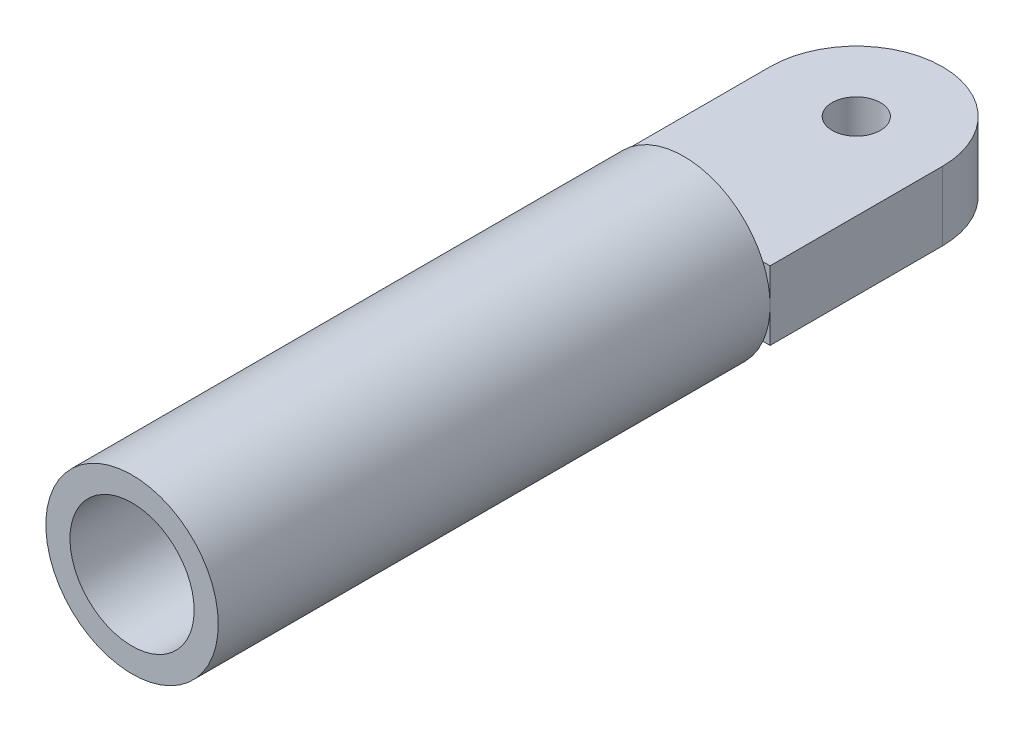
ISO-10303-21;
HEADER;
FILE_DESCRIPTION(('STEP AP214'),'2;1');
FILE_NAME('part.step','',(''),(''),'','','');
FILE_SCHEMA(('AUTOMOTIVE_DESIGN { 1 0 10303 214 1 1 1 1 }'));
ENDSEC;
DATA;
#1=APPLICATION_CONTEXT('core data for automotive mechanical design processes');
#2=APPLICATION_PROTOCOL_DEFINITION('international standard','automotive_design',2000,#1);
#3=PRODUCT_CONTEXT('',#1,'mechanical');
#4=PRODUCT('Part','Part','',(#3));
#5=PRODUCT_RELATED_PRODUCT_CATEGORY('part','',(#4));
#6=PRODUCT_DEFINITION_FORMATION('','',#4);
#7=PRODUCT_DEFINITION_CONTEXT('part definition',#1,'design');
#8=PRODUCT_DEFINITION('design','',#6,#7);
#9=PRODUCT_DEFINITION_SHAPE('','',#8);
#10=(LENGTH_UNIT() NAMED_UNIT(*) SI_UNIT(.MILLI.,.METRE.));
#11=(NAMED_UNIT(*) PLANE_ANGLE_UNIT() SI_UNIT($,.RADIAN.));
#12=(NAMED_UNIT(*) SI_UNIT($,.STERADIAN.) SOLID_ANGLE_UNIT());
#13=UNCERTAINTY_MEASURE_WITH_UNIT(LENGTH_MEASURE(1.E-05),#10,'distance_accuracy_value','');
#14=(GEOMETRIC_REPRESENTATION_CONTEXT(3) GLOBAL_UNCERTAINTY_ASSIGNED_CONTEXT((#13)) GLOBAL_UNIT_ASSIGNED_CONTEXT((#10,
#11,#12)) REPRESENTATION_CONTEXT('',''));
#15=CARTESIAN_POINT('',(0.,0.,0.));
#16=DIRECTION('',(0.,0.,1.));
#17=DIRECTION('',(1.,0.,0.));
#18=AXIS2_PLACEMENT_3D('',#15,#16,#17);
#19=CARTESIAN_POINT('',(0.,0.,0.));
#20=DIRECTION('',(0.,0.,1.));
#21=DIRECTION('',(1.,0.,0.));
#22=AXIS2_PLACEMENT_3D('',#19,#20,#21);
#23=PLANE('',#22);
#24=DIRECTION('',(1.,0.,0.));
#25=VECTOR('',#24,1.);
#26=CARTESIAN_POINT('',(-12.5,5.,0.));
#27=LINE('',#26,#25);
#28=CARTESIAN_POINT('',(-11.4564392373896,5.,0.));
#29=VERTEX_POINT('',#28);
#30=CARTESIAN_POINT('',(-7.48331477354788,5.,0.));
#31=VERTEX_POINT('',#30);
#32=EDGE_CURVE('E153',#29,#31,#27,.T.);
#33=ORIENTED_EDGE('',*,*,#32,.F.);
#34=CARTESIAN_POINT('',(0.,0.,0.));
#35=DIRECTION('',(0.,0.,1.));
#36=DIRECTION('',(1.,0.,0.));
#37=AXIS2_PLACEMENT_3D('',#34,#35,#36);
#38=CIRCLE('',#37,12.5);
#39=CARTESIAN_POINT('',(11.4564392373896,5.,0.));
#40=VERTEX_POINT('',#39);
#41=EDGE_CURVE('E154',#40,#29,#38,.T.);
#42=ORIENTED_EDGE('',*,*,#41,.F.);
#43=CARTESIAN_POINT('',(7.48331477354788,5.,0.));
#44=VERTEX_POINT('',#43);
#45=EDGE_CURVE('E120',#44,#40,#27,.T.);
#46=ORIENTED_EDGE('',*,*,#45,.F.);
#47=CARTESIAN_POINT('',(0.,0.,0.));
#48=DIRECTION('',(0.,0.,1.));
#49=DIRECTION('',(1.,0.,0.));
#50=AXIS2_PLACEMENT_3D('',#47,#48,#49);
#51=CIRCLE('',#50,9.);
#52=EDGE_CURVE('E139',#44,#31,#51,.T.);
#53=ORIENTED_EDGE('',*,*,#52,.T.);
#54=EDGE_LOOP('',(#33,#42,#46,#53));
#55=FACE_BOUND('',#54,.T.);
#56=ADVANCED_FACE('F34',(#55),#23,.F.);
#57=CARTESIAN_POINT('',(0.,0.,80.));
#58=DIRECTION('',(0.,0.,1.));
#59=DIRECTION('',(1.,0.,0.));
#60=AXIS2_PLACEMENT_3D('',#57,#58,#59);
#61=PLANE('',#60);
#62=CARTESIAN_POINT('',(0.,0.,80.));
#63=DIRECTION('',(0.,0.,1.));
#64=DIRECTION('',(1.,0.,0.));
#65=AXIS2_PLACEMENT_3D('',#62,#63,#64);
#66=CIRCLE('',#65,12.5);
#67=CARTESIAN_POINT('',(12.5,0.,80.));
#68=VERTEX_POINT('',#67);
#69=EDGE_CURVE('E148',#68,#68,#66,.T.);
#70=ORIENTED_EDGE('',*,*,#69,.T.);
#71=EDGE_LOOP('',(#70));
#72=FACE_BOUND('',#71,.T.);
#73=CARTESIAN_POINT('',(0.,0.,80.));
#74=DIRECTION('',(0.,0.,1.));
#75=DIRECTION('',(1.,0.,0.));
#76=AXIS2_PLACEMENT_3D('',#73,#74,#75);
#77=CIRCLE('',#76,9.);
#78=CARTESIAN_POINT('',(9.,0.,80.));
#79=VERTEX_POINT('',#78);
#80=EDGE_CURVE('E144',#79,#79,#77,.T.);
#81=ORIENTED_EDGE('',*,*,#80,.F.);
#82=EDGE_LOOP('',(#81));
#83=FACE_BOUND('',#82,.T.);
#84=ADVANCED_FACE('F221',(#72,#83),#61,.T.);
#85=CARTESIAN_POINT('',(-11.4564392373896,-5.,0.));
#86=VERTEX_POINT('',#85);
#87=CARTESIAN_POINT('',(11.4564392373896,-5.,0.));
#88=VERTEX_POINT('',#87);
#89=EDGE_CURVE('E159',#86,#88,#38,.T.);
#90=ORIENTED_EDGE('',*,*,#89,.F.);
#91=DIRECTION('',(1.,0.,0.));
#92=VECTOR('',#91,1.);
#93=CARTESIAN_POINT('',(-12.5,-5.,0.));
#94=LINE('',#93,#92);
#95=CARTESIAN_POINT('',(-7.48331477354788,-5.,0.));
#96=VERTEX_POINT('',#95);
#97=EDGE_CURVE('E11',#86,#96,#94,.T.);
#98=ORIENTED_EDGE('',*,*,#97,.T.);
#99=CARTESIAN_POINT('',(7.48331477354788,-5.,0.));
#100=VERTEX_POINT('',#99);
#101=EDGE_CURVE('E137',#96,#100,#51,.T.);
#102=ORIENTED_EDGE('',*,*,#101,.T.);
#103=EDGE_CURVE('E43',#100,#88,#94,.T.);
#104=ORIENTED_EDGE('',*,*,#103,.T.);
#105=EDGE_LOOP('',(#90,#98,#102,#104));
#106=FACE_BOUND('',#105,.T.);
#107=ADVANCED_FACE('F223',(#106),#23,.F.);
#108=CARTESIAN_POINT('',(0.,0.,80.));
#109=DIRECTION('',(0.,0.,-1.));
#110=DIRECTION('',(-1.,0.,0.));
#111=AXIS2_PLACEMENT_3D('',#108,#109,#110);
#112=CYLINDRICAL_SURFACE('',#111,12.5);
#113=ORIENTED_EDGE('',*,*,#69,.F.);
#114=EDGE_LOOP('',(#113));
#115=FACE_BOUND('',#114,.T.);
#116=CARTESIAN_POINT('',(12.5,0.,0.));
#117=VERTEX_POINT('',#116);
#118=EDGE_CURVE('E38',#117,#40,#38,.T.);
#119=ORIENTED_EDGE('',*,*,#118,.T.);
#120=ORIENTED_EDGE('',*,*,#41,.T.);
#121=CARTESIAN_POINT('',(-12.5,0.,0.));
#122=VERTEX_POINT('',#121);
#123=EDGE_CURVE('E113',#29,#122,#38,.T.);
#124=ORIENTED_EDGE('',*,*,#123,.T.);
#125=EDGE_CURVE('E162',#122,#86,#38,.T.);
#126=ORIENTED_EDGE('',*,*,#125,.T.);
#127=ORIENTED_EDGE('',*,*,#89,.T.);
#128=EDGE_CURVE('E146',#88,#117,#38,.T.);
#129=ORIENTED_EDGE('',*,*,#128,.T.);
#130=EDGE_LOOP('',(#119,#120,#124,#126,#127,#129));
#131=FACE_BOUND('',#130,.T.);
#132=ADVANCED_FACE('F36',(#115,#131),#112,.T.);
#133=CARTESIAN_POINT('',(0.,0.,80.));
#134=DIRECTION('',(0.,0.,-1.));
#135=DIRECTION('',(-1.,0.,0.));
#136=AXIS2_PLACEMENT_3D('',#133,#134,#135);
#137=CYLINDRICAL_SURFACE('',#136,9.);
#138=ORIENTED_EDGE('',*,*,#80,.T.);
#139=EDGE_LOOP('',(#138));
#140=FACE_BOUND('',#139,.T.);
#141=ORIENTED_EDGE('',*,*,#52,.F.);
#142=EDGE_CURVE('E52',#100,#44,#51,.T.);
#143=ORIENTED_EDGE('',*,*,#142,.F.);
#144=ORIENTED_EDGE('',*,*,#101,.F.);
#145=EDGE_CURVE('E147',#31,#96,#51,.T.);
#146=ORIENTED_EDGE('',*,*,#145,.F.);
#147=EDGE_LOOP('',(#141,#143,#144,#146));
#148=FACE_BOUND('',#147,.T.);
#149=ADVANCED_FACE('F232',(#140,#148),#137,.F.);
#150=CARTESIAN_POINT('',(-12.5,5.,0.));
#151=DIRECTION('',(0.,0.,-1.));
#152=DIRECTION('',(-1.,0.,0.));
#153=AXIS2_PLACEMENT_3D('',#150,#151,#152);
#154=PLANE('',#153);
#155=ORIENTED_EDGE('',*,*,#123,.F.);
#156=CARTESIAN_POINT('',(-12.5,5.,0.));
#157=VERTEX_POINT('',#156);
#158=EDGE_CURVE('E108',#157,#29,#27,.T.);
#159=ORIENTED_EDGE('',*,*,#158,.F.);
#160=DIRECTION('',(0.,-1.,0.));
#161=VECTOR('',#160,1.);
#162=CARTESIAN_POINT('',(-12.5,5.,0.));
#163=LINE('',#162,#161);
#164=EDGE_CURVE('E112',#157,#122,#163,.T.);
#165=ORIENTED_EDGE('',*,*,#164,.T.);
#166=EDGE_LOOP('',(#155,#159,#165));
#167=FACE_BOUND('',#166,.T.);
#168=ADVANCED_FACE('F110',(#167),#154,.F.);
#169=ORIENTED_EDGE('',*,*,#118,.F.);
#170=DIRECTION('',(0.,-1.,0.));
#171=VECTOR('',#170,1.);
#172=CARTESIAN_POINT('',(12.5,5.,0.));
#173=LINE('',#172,#171);
#174=CARTESIAN_POINT('',(12.5,5.,0.));
#175=VERTEX_POINT('',#174);
#176=EDGE_CURVE('E140',#175,#117,#173,.T.);
#177=ORIENTED_EDGE('',*,*,#176,.F.);
#178=EDGE_CURVE('E119',#40,#175,#27,.T.);
#179=ORIENTED_EDGE('',*,*,#178,.F.);
#180=EDGE_LOOP('',(#169,#177,#179));
#181=FACE_BOUND('',#180,.T.);
#182=ADVANCED_FACE('F189',(#181),#154,.F.);
#183=EDGE_CURVE('E117',#31,#44,#27,.T.);
#184=ORIENTED_EDGE('',*,*,#183,.F.);
#185=ORIENTED_EDGE('',*,*,#145,.T.);
#186=EDGE_CURVE('E45',#96,#100,#94,.T.);
#187=ORIENTED_EDGE('',*,*,#186,.T.);
#188=ORIENTED_EDGE('',*,*,#142,.T.);
#189=EDGE_LOOP('',(#184,#185,#187,#188));
#190=FACE_BOUND('',#189,.T.);
#191=ADVANCED_FACE('F256',(#190),#154,.F.);
#192=ORIENTED_EDGE('',*,*,#125,.F.);
#193=CARTESIAN_POINT('',(-12.5,-5.,0.));
#194=VERTEX_POINT('',#193);
#195=EDGE_CURVE('E135',#122,#194,#163,.T.);
#196=ORIENTED_EDGE('',*,*,#195,.T.);
#197=EDGE_CURVE('E169',#194,#86,#94,.T.);
#198=ORIENTED_EDGE('',*,*,#197,.T.);
#199=EDGE_LOOP('',(#192,#196,#198));
#200=FACE_BOUND('',#199,.T.);
#201=ADVANCED_FACE('F167',(#200),#154,.F.);
#202=CARTESIAN_POINT('',(0.,5.,-25.));
#203=DIRECTION('',(0.,-1.,0.));
#204=DIRECTION('',(0.,0.,-1.));
#205=AXIS2_PLACEMENT_3D('',#202,#203,#204);
#206=PLANE('',#205);
#207=DIRECTION('',(0.,0.,1.));
#208=VECTOR('',#207,1.);
#209=CARTESIAN_POINT('',(-12.5,5.,0.));
#210=LINE('',#209,#208);
#211=CARTESIAN_POINT('',(-12.5,5.,-25.));
#212=VERTEX_POINT('',#211);
#213=EDGE_CURVE('E122',#212,#157,#210,.T.);
#214=ORIENTED_EDGE('',*,*,#213,.T.);
#215=ORIENTED_EDGE('',*,*,#158,.T.);
#216=ORIENTED_EDGE('',*,*,#32,.T.);
#217=ORIENTED_EDGE('',*,*,#183,.T.);
#218=ORIENTED_EDGE('',*,*,#45,.T.);
#219=ORIENTED_EDGE('',*,*,#178,.T.);
#220=DIRECTION('',(0.,0.,-1.));
#221=VECTOR('',#220,1.);
#222=CARTESIAN_POINT('',(12.5,5.,0.));
#223=LINE('',#222,#221);
#224=CARTESIAN_POINT('',(12.5,5.,-25.));
#225=VERTEX_POINT('',#224);
#226=EDGE_CURVE('E116',#175,#225,#223,.T.);
#227=ORIENTED_EDGE('',*,*,#226,.T.);
#228=CARTESIAN_POINT('',(0.,5.,-25.));
#229=DIRECTION('',(0.,1.,0.));
#230=DIRECTION('',(0.,0.,-1.));
#231=AXIS2_PLACEMENT_3D('',#228,#229,#230);
#232=CIRCLE('',#231,12.5);
#233=EDGE_CURVE('E126',#225,#212,#232,.T.);
#234=ORIENTED_EDGE('',*,*,#233,.T.);
#235=EDGE_LOOP('',(#214,#215,#216,#217,#218,#219,#227,#234));
#236=FACE_BOUND('',#235,.T.);
#237=CARTESIAN_POINT('',(0.,5.,-25.));
#238=DIRECTION('',(0.,1.,0.));
#239=DIRECTION('',(0.,0.,1.));
#240=AXIS2_PLACEMENT_3D('',#237,#238,#239);
#241=CIRCLE('',#240,3.5);
#242=CARTESIAN_POINT('',(0.,5.,-21.5));
#243=VERTEX_POINT('',#242);
#244=EDGE_CURVE('E198',#243,#243,#241,.T.);
#245=ORIENTED_EDGE('',*,*,#244,.F.);
#246=EDGE_LOOP('',(#245));
#247=FACE_BOUND('',#246,.T.);
#248=ADVANCED_FACE('F123',(#236,#247),#206,.F.);
#249=CARTESIAN_POINT('',(0.,-5.,-25.));
#250=DIRECTION('',(0.,-1.,0.));
#251=DIRECTION('',(0.,0.,-1.));
#252=AXIS2_PLACEMENT_3D('',#249,#250,#251);
#253=PLANE('',#252);
#254=DIRECTION('',(0.,0.,1.));
#255=VECTOR('',#254,1.);
#256=CARTESIAN_POINT('',(-12.5,-5.,0.));
#257=LINE('',#256,#255);
#258=CARTESIAN_POINT('',(-12.5,-5.,-25.));
#259=VERTEX_POINT('',#258);
#260=EDGE_CURVE('E178',#259,#194,#257,.T.);
#261=ORIENTED_EDGE('',*,*,#260,.F.);
#262=CARTESIAN_POINT('',(0.,-5.,-25.));
#263=DIRECTION('',(0.,1.,0.));
#264=DIRECTION('',(0.,0.,-1.));
#265=AXIS2_PLACEMENT_3D('',#262,#263,#264);
#266=CIRCLE('',#265,12.5);
#267=CARTESIAN_POINT('',(12.5,-5.,-25.));
#268=VERTEX_POINT('',#267);
#269=EDGE_CURVE('E130',#268,#259,#266,.T.);
#270=ORIENTED_EDGE('',*,*,#269,.F.);
#271=DIRECTION('',(0.,0.,-1.));
#272=VECTOR('',#271,1.);
#273=CARTESIAN_POINT('',(12.5,-5.,0.));
#274=LINE('',#273,#272);
#275=CARTESIAN_POINT('',(12.5,-5.,0.));
#276=VERTEX_POINT('',#275);
#277=EDGE_CURVE('E172',#276,#268,#274,.T.);
#278=ORIENTED_EDGE('',*,*,#277,.F.);
#279=EDGE_CURVE('E173',#88,#276,#94,.T.);
#280=ORIENTED_EDGE('',*,*,#279,.F.);
#281=ORIENTED_EDGE('',*,*,#103,.F.);
#282=ORIENTED_EDGE('',*,*,#186,.F.);
#283=ORIENTED_EDGE('',*,*,#97,.F.);
#284=ORIENTED_EDGE('',*,*,#197,.F.);
#285=EDGE_LOOP('',(#261,#270,#278,#280,#281,#282,#283,#284));
#286=FACE_BOUND('',#285,.T.);
#287=CARTESIAN_POINT('',(0.,-5.,-25.));
#288=DIRECTION('',(0.,1.,0.));
#289=DIRECTION('',(0.,0.,1.));
#290=AXIS2_PLACEMENT_3D('',#287,#288,#289);
#291=CIRCLE('',#290,3.5);
#292=CARTESIAN_POINT('',(0.,-5.,-21.5));
#293=VERTEX_POINT('',#292);
#294=EDGE_CURVE('E200',#293,#293,#291,.T.);
#295=ORIENTED_EDGE('',*,*,#294,.T.);
#296=EDGE_LOOP('',(#295));
#297=FACE_BOUND('',#296,.T.);
#298=ADVANCED_FACE('F208',(#286,#297),#253,.T.);
#299=CARTESIAN_POINT('',(-12.5,5.,0.));
#300=DIRECTION('',(1.,0.,0.));
#301=DIRECTION('',(0.,0.,-1.));
#302=AXIS2_PLACEMENT_3D('',#299,#300,#301);
#303=PLANE('',#302);
#304=ORIENTED_EDGE('',*,*,#260,.T.);
#305=ORIENTED_EDGE('',*,*,#195,.F.);
#306=ORIENTED_EDGE('',*,*,#164,.F.);
#307=ORIENTED_EDGE('',*,*,#213,.F.);
#308=DIRECTION('',(0.,-1.,0.));
#309=VECTOR('',#308,1.);
#310=CARTESIAN_POINT('',(-12.5,5.,-25.));
#311=LINE('',#310,#309);
#312=EDGE_CURVE('E196',#212,#259,#311,.T.);
#313=ORIENTED_EDGE('',*,*,#312,.T.);
#314=EDGE_LOOP('',(#304,#305,#306,#307,#313));
#315=FACE_BOUND('',#314,.T.);
#316=ADVANCED_FACE('F134',(#315),#303,.F.);
#317=ORIENTED_EDGE('',*,*,#128,.F.);
#318=ORIENTED_EDGE('',*,*,#279,.T.);
#319=EDGE_CURVE('E192',#117,#276,#173,.T.);
#320=ORIENTED_EDGE('',*,*,#319,.F.);
#321=EDGE_LOOP('',(#317,#318,#320));
#322=FACE_BOUND('',#321,.T.);
#323=ADVANCED_FACE('F243',(#322),#154,.F.);
#324=CARTESIAN_POINT('',(12.5,5.,0.));
#325=DIRECTION('',(-1.,0.,0.));
#326=DIRECTION('',(0.,0.,1.));
#327=AXIS2_PLACEMENT_3D('',#324,#325,#326);
#328=PLANE('',#327);
#329=ORIENTED_EDGE('',*,*,#277,.T.);
#330=DIRECTION('',(0.,-1.,0.));
#331=VECTOR('',#330,1.);
#332=CARTESIAN_POINT('',(12.5,5.,-25.));
#333=LINE('',#332,#331);
#334=EDGE_CURVE('E195',#225,#268,#333,.T.);
#335=ORIENTED_EDGE('',*,*,#334,.F.);
#336=ORIENTED_EDGE('',*,*,#226,.F.);
#337=ORIENTED_EDGE('',*,*,#176,.T.);
#338=ORIENTED_EDGE('',*,*,#319,.T.);
#339=EDGE_LOOP('',(#329,#335,#336,#337,#338));
#340=FACE_BOUND('',#339,.T.);
#341=ADVANCED_FACE('F193',(#340),#328,.F.);
#342=CARTESIAN_POINT('',(0.,5.,-25.));
#343=DIRECTION('',(0.,-1.,0.));
#344=DIRECTION('',(0.,0.,-1.));
#345=AXIS2_PLACEMENT_3D('',#342,#343,#344);
#346=CYLINDRICAL_SURFACE('',#345,12.5);
#347=ORIENTED_EDGE('',*,*,#269,.T.);
#348=ORIENTED_EDGE('',*,*,#312,.F.);
#349=ORIENTED_EDGE('',*,*,#233,.F.);
#350=ORIENTED_EDGE('',*,*,#334,.T.);
#351=EDGE_LOOP('',(#347,#348,#349,#350));
#352=FACE_BOUND('',#351,.T.);
#353=ADVANCED_FACE('F212',(#352),#346,.T.);
#354=CARTESIAN_POINT('',(0.,5.,-25.));
#355=DIRECTION('',(0.,-1.,0.));
#356=DIRECTION('',(0.,0.,-1.));
#357=AXIS2_PLACEMENT_3D('',#354,#355,#356);
#358=CYLINDRICAL_SURFACE('',#357,3.5);
#359=ORIENTED_EDGE('',*,*,#244,.T.);
#360=EDGE_LOOP('',(#359));
#361=FACE_BOUND('',#360,.T.);
#362=ORIENTED_EDGE('',*,*,#294,.F.);
#363=EDGE_LOOP('',(#362));
#364=FACE_BOUND('',#363,.T.);
#365=ADVANCED_FACE('F210',(#361,#364),#358,.F.);
#366=CLOSED_SHELL('',(#56,#84,#107,#132,#149,#168,#182,#191,#201,#248,#298,#316,#323,#341,#353,#365));
#367=MANIFOLD_SOLID_BREP('B2',#366);
#368=ADVANCED_BREP_SHAPE_REPRESENTATION('',(#18,#367),#14);
#369=SHAPE_DEFINITION_REPRESENTATION(#9,#368);
ENDSEC;
END-ISO-10303-21;
